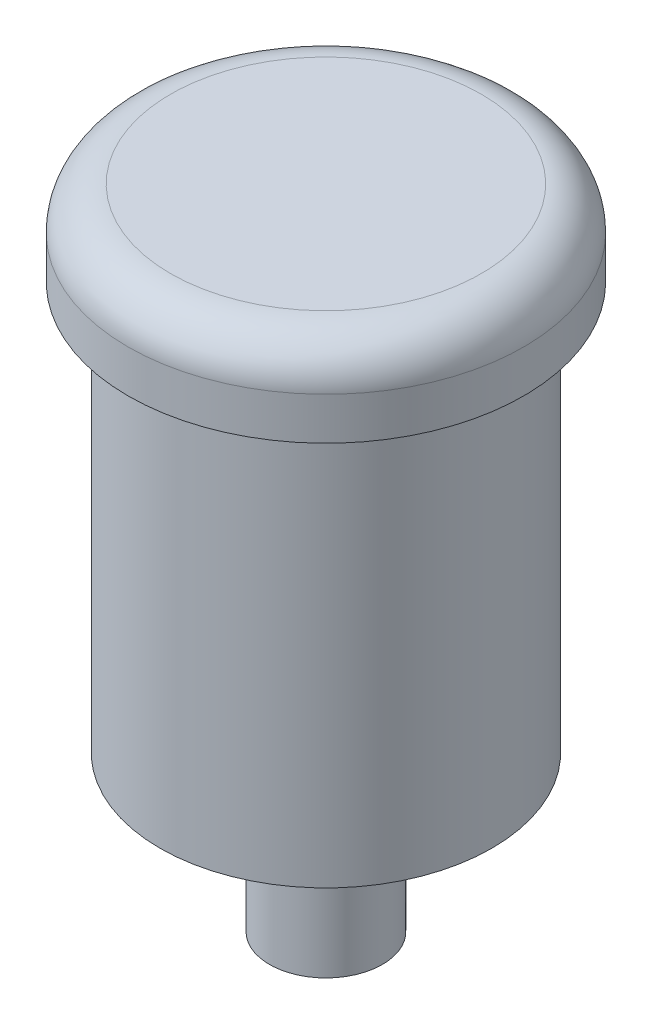
ISO-10303-21;
HEADER;
FILE_DESCRIPTION(('STEP AP214'),'2;1');
FILE_NAME('part.step','',(''),(''),'','','');
FILE_SCHEMA(('AUTOMOTIVE_DESIGN { 1 0 10303 214 1 1 1 1 }'));
ENDSEC;
DATA;
#1=APPLICATION_CONTEXT('core data for automotive mechanical design processes');
#2=APPLICATION_PROTOCOL_DEFINITION('international standard','automotive_design',2000,#1);
#3=PRODUCT_CONTEXT('',#1,'mechanical');
#4=PRODUCT('Part','Part','',(#3));
#5=PRODUCT_RELATED_PRODUCT_CATEGORY('part','',(#4));
#6=PRODUCT_DEFINITION_FORMATION('','',#4);
#7=PRODUCT_DEFINITION_CONTEXT('part definition',#1,'design');
#8=PRODUCT_DEFINITION('design','',#6,#7);
#9=PRODUCT_DEFINITION_SHAPE('','',#8);
#10=(LENGTH_UNIT() NAMED_UNIT(*) SI_UNIT(.MILLI.,.METRE.));
#11=(NAMED_UNIT(*) PLANE_ANGLE_UNIT() SI_UNIT($,.RADIAN.));
#12=(NAMED_UNIT(*) SI_UNIT($,.STERADIAN.) SOLID_ANGLE_UNIT());
#13=UNCERTAINTY_MEASURE_WITH_UNIT(LENGTH_MEASURE(1.E-05),#10,'distance_accuracy_value','');
#14=(GEOMETRIC_REPRESENTATION_CONTEXT(3) GLOBAL_UNCERTAINTY_ASSIGNED_CONTEXT((#13)) GLOBAL_UNIT_ASSIGNED_CONTEXT((#10,
#11,#12)) REPRESENTATION_CONTEXT('',''));
#15=CARTESIAN_POINT('',(0.,0.,0.));
#16=DIRECTION('',(0.,0.,1.));
#17=DIRECTION('',(1.,0.,0.));
#18=AXIS2_PLACEMENT_3D('',#15,#16,#17);
#19=CARTESIAN_POINT('',(-10.4255970889602,-28.85,-8.3271805835252));
#20=DIRECTION('',(0.,-1.,0.));
#21=DIRECTION('',(0.,0.,-1.));
#22=AXIS2_PLACEMENT_3D('',#19,#20,#21);
#23=PLANE('',#22);
#24=CARTESIAN_POINT('',(-10.4255970889602,-28.85,-8.3271805835252));
#25=DIRECTION('',(0.,-1.,0.));
#26=DIRECTION('',(0.,0.,-1.));
#27=AXIS2_PLACEMENT_3D('',#24,#25,#26);
#28=CIRCLE('',#27,11.75);
#29=CARTESIAN_POINT('',(-10.4255970889602,-28.85,-20.0771805835252));
#30=VERTEX_POINT('',#29);
#31=EDGE_CURVE('E51',#30,#30,#28,.T.);
#32=ORIENTED_EDGE('',*,*,#31,.T.);
#33=EDGE_LOOP('',(#32));
#34=FACE_BOUND('',#33,.T.);
#35=CARTESIAN_POINT('',(-10.4255970889602,-28.85,-8.3271805835252));
#36=DIRECTION('',(0.,-1.,0.));
#37=DIRECTION('',(0.,0.,-1.));
#38=AXIS2_PLACEMENT_3D('',#35,#36,#37);
#39=CIRCLE('',#38,4.);
#40=CARTESIAN_POINT('',(-10.4255970889602,-28.85,-12.3271805835252));
#41=VERTEX_POINT('',#40);
#42=EDGE_CURVE('E55',#41,#41,#39,.T.);
#43=ORIENTED_EDGE('',*,*,#42,.F.);
#44=EDGE_LOOP('',(#43));
#45=FACE_BOUND('',#44,.T.);
#46=ADVANCED_FACE('F31',(#34,#45),#23,.T.);
#47=CARTESIAN_POINT('',(-10.4255970889602,0.,-8.3271805835252));
#48=DIRECTION('',(0.,1.,0.));
#49=DIRECTION('',(0.,0.,1.));
#50=AXIS2_PLACEMENT_3D('',#47,#48,#49);
#51=PLANE('',#50);
#52=CARTESIAN_POINT('',(-10.4255970889602,0.,-8.3271805835252));
#53=DIRECTION('',(0.,1.,0.));
#54=DIRECTION('',(0.,0.,1.));
#55=AXIS2_PLACEMENT_3D('',#52,#53,#54);
#56=CIRCLE('',#55,14.);
#57=CARTESIAN_POINT('',(-10.4255970889602,0.,5.67281941647479));
#58=VERTEX_POINT('',#57);
#59=EDGE_CURVE('E46',#58,#58,#56,.T.);
#60=ORIENTED_EDGE('',*,*,#59,.F.);
#61=EDGE_LOOP('',(#60));
#62=FACE_BOUND('',#61,.T.);
#63=CARTESIAN_POINT('',(-10.4255970889602,0.,-8.3271805835252));
#64=DIRECTION('',(0.,1.,0.));
#65=DIRECTION('',(0.,0.,1.));
#66=AXIS2_PLACEMENT_3D('',#63,#64,#65);
#67=CIRCLE('',#66,11.75);
#68=CARTESIAN_POINT('',(-10.4255970889602,0.,3.4228194164748));
#69=VERTEX_POINT('',#68);
#70=EDGE_CURVE('E42',#69,#69,#67,.F.);
#71=ORIENTED_EDGE('',*,*,#70,.F.);
#72=EDGE_LOOP('',(#71));
#73=FACE_BOUND('',#72,.T.);
#74=ADVANCED_FACE('F70',(#62,#73),#51,.F.);
#75=CARTESIAN_POINT('',(-10.4255970889602,6.,-8.3271805835252));
#76=DIRECTION('',(0.,-1.,0.));
#77=DIRECTION('',(0.,0.,-1.));
#78=AXIS2_PLACEMENT_3D('',#75,#76,#77);
#79=CYLINDRICAL_SURFACE('',#78,14.);
#80=CARTESIAN_POINT('',(-10.4255970889602,3.,-8.3271805835252));
#81=DIRECTION('',(0.,1.,0.));
#82=DIRECTION('',(0.,0.,1.));
#83=AXIS2_PLACEMENT_3D('',#80,#81,#82);
#84=CIRCLE('',#83,14.);
#85=CARTESIAN_POINT('',(-10.4255970889602,3.,5.67281941647479));
#86=VERTEX_POINT('',#85);
#87=EDGE_CURVE('E10',#86,#86,#84,.F.);
#88=ORIENTED_EDGE('',*,*,#87,.T.);
#89=EDGE_LOOP('',(#88));
#90=FACE_BOUND('',#89,.T.);
#91=ORIENTED_EDGE('',*,*,#59,.T.);
#92=EDGE_LOOP('',(#91));
#93=FACE_BOUND('',#92,.T.);
#94=ADVANCED_FACE('F76',(#90,#93),#79,.T.);
#95=CARTESIAN_POINT('',(-10.4255970889602,6.,-8.3271805835252));
#96=DIRECTION('',(0.,1.,0.));
#97=DIRECTION('',(0.,0.,1.));
#98=AXIS2_PLACEMENT_3D('',#95,#96,#97);
#99=PLANE('',#98);
#100=CARTESIAN_POINT('',(-10.4255970889602,6.,-8.3271805835252));
#101=DIRECTION('',(0.,1.,0.));
#102=DIRECTION('',(0.,0.,1.));
#103=AXIS2_PLACEMENT_3D('',#100,#101,#102);
#104=CIRCLE('',#103,11.);
#105=CARTESIAN_POINT('',(-10.4255970889602,6.,2.6728194164748));
#106=VERTEX_POINT('',#105);
#107=EDGE_CURVE('E38',#106,#106,#104,.T.);
#108=ORIENTED_EDGE('',*,*,#107,.T.);
#109=EDGE_LOOP('',(#108));
#110=FACE_BOUND('',#109,.T.);
#111=ADVANCED_FACE('F84',(#110),#99,.T.);
#112=CARTESIAN_POINT('',(-10.4255970889602,-28.85,-8.3271805835252));
#113=DIRECTION('',(0.,1.,0.));
#114=DIRECTION('',(0.,0.,1.));
#115=AXIS2_PLACEMENT_3D('',#112,#113,#114);
#116=CYLINDRICAL_SURFACE('',#115,11.75);
#117=ORIENTED_EDGE('',*,*,#31,.F.);
#118=EDGE_LOOP('',(#117));
#119=FACE_BOUND('',#118,.T.);
#120=ORIENTED_EDGE('',*,*,#70,.T.);
#121=EDGE_LOOP('',(#120));
#122=FACE_BOUND('',#121,.T.);
#123=ADVANCED_FACE('F81',(#119,#122),#116,.T.);
#124=CARTESIAN_POINT('',(-10.4255970889602,3.,-8.3271805835252));
#125=DIRECTION('',(0.,1.,0.));
#126=DIRECTION('',(0.,0.,1.));
#127=AXIS2_PLACEMENT_3D('',#124,#125,#126);
#128=TOROIDAL_SURFACE('',#127,11.,3.);
#129=ORIENTED_EDGE('',*,*,#87,.F.);
#130=EDGE_LOOP('',(#129));
#131=FACE_BOUND('',#130,.T.);
#132=ORIENTED_EDGE('',*,*,#107,.F.);
#133=EDGE_LOOP('',(#132));
#134=FACE_BOUND('',#133,.T.);
#135=ADVANCED_FACE('F33',(#131,#134),#128,.T.);
#136=CARTESIAN_POINT('',(-10.4255970889602,-39.85,-8.3271805835252));
#137=DIRECTION('',(0.,1.,0.));
#138=DIRECTION('',(0.,0.,1.));
#139=AXIS2_PLACEMENT_3D('',#136,#137,#138);
#140=CYLINDRICAL_SURFACE('',#139,4.);
#141=CARTESIAN_POINT('',(-10.4255970889602,-39.85,-8.3271805835252));
#142=DIRECTION('',(0.,-1.,0.));
#143=DIRECTION('',(0.,0.,-1.));
#144=AXIS2_PLACEMENT_3D('',#141,#142,#143);
#145=CIRCLE('',#144,4.);
#146=CARTESIAN_POINT('',(-10.4255970889602,-39.85,-12.3271805835252));
#147=VERTEX_POINT('',#146);
#148=EDGE_CURVE('E54',#147,#147,#145,.T.);
#149=ORIENTED_EDGE('',*,*,#148,.F.);
#150=EDGE_LOOP('',(#149));
#151=FACE_BOUND('',#150,.T.);
#152=ORIENTED_EDGE('',*,*,#42,.T.);
#153=EDGE_LOOP('',(#152));
#154=FACE_BOUND('',#153,.T.);
#155=ADVANCED_FACE('F63',(#151,#154),#140,.T.);
#156=CARTESIAN_POINT('',(-10.4255970889602,-39.85,-8.3271805835252));
#157=DIRECTION('',(0.,-1.,0.));
#158=DIRECTION('',(0.,0.,-1.));
#159=AXIS2_PLACEMENT_3D('',#156,#157,#158);
#160=PLANE('',#159);
#161=ORIENTED_EDGE('',*,*,#148,.T.);
#162=EDGE_LOOP('',(#161));
#163=FACE_BOUND('',#162,.T.);
#164=ADVANCED_FACE('F61',(#163),#160,.T.);
#165=CLOSED_SHELL('',(#46,#74,#94,#111,#123,#135,#155,#164));
#166=MANIFOLD_SOLID_BREP('B2',#165);
#167=ADVANCED_BREP_SHAPE_REPRESENTATION('',(#18,#166),#14);
#168=SHAPE_DEFINITION_REPRESENTATION(#9,#167);
ENDSEC;
END-ISO-10303-21;
